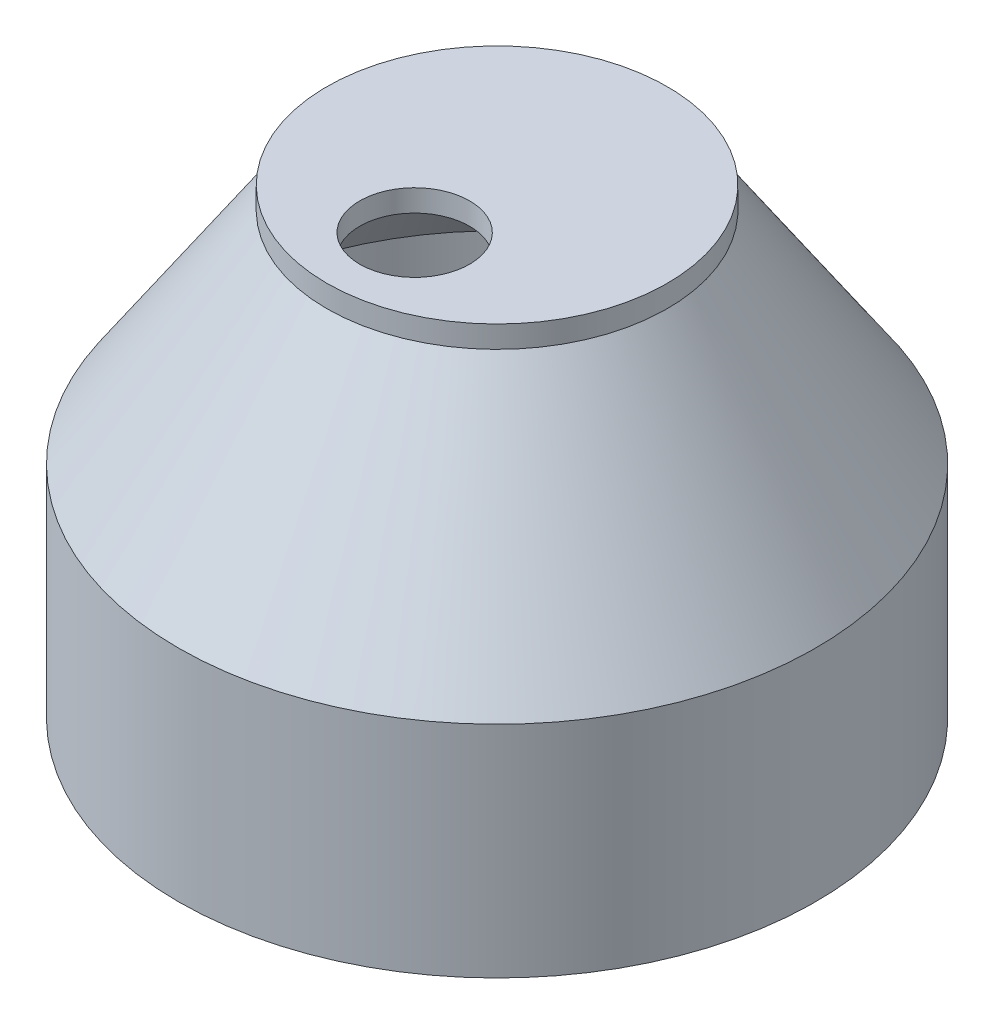
ISO-10303-21;
HEADER;
FILE_DESCRIPTION(('STEP AP214'),'2;1');
FILE_NAME('part.step','',(''),(''),'','','');
FILE_SCHEMA(('AUTOMOTIVE_DESIGN { 1 0 10303 214 1 1 1 1 }'));
ENDSEC;
DATA;
#1=APPLICATION_CONTEXT('core data for automotive mechanical design processes');
#2=APPLICATION_PROTOCOL_DEFINITION('international standard','automotive_design',2000,#1);
#3=PRODUCT_CONTEXT('',#1,'mechanical');
#4=PRODUCT('Part','Part','',(#3));
#5=PRODUCT_RELATED_PRODUCT_CATEGORY('part','',(#4));
#6=PRODUCT_DEFINITION_FORMATION('','',#4);
#7=PRODUCT_DEFINITION_CONTEXT('part definition',#1,'design');
#8=PRODUCT_DEFINITION('design','',#6,#7);
#9=PRODUCT_DEFINITION_SHAPE('','',#8);
#10=(LENGTH_UNIT() NAMED_UNIT(*) SI_UNIT(.MILLI.,.METRE.));
#11=(NAMED_UNIT(*) PLANE_ANGLE_UNIT() SI_UNIT($,.RADIAN.));
#12=(NAMED_UNIT(*) SI_UNIT($,.STERADIAN.) SOLID_ANGLE_UNIT());
#13=UNCERTAINTY_MEASURE_WITH_UNIT(LENGTH_MEASURE(1.E-05),#10,'distance_accuracy_value','');
#14=(GEOMETRIC_REPRESENTATION_CONTEXT(3) GLOBAL_UNCERTAINTY_ASSIGNED_CONTEXT((#13)) GLOBAL_UNIT_ASSIGNED_CONTEXT((#10,
#11,#12)) REPRESENTATION_CONTEXT('',''));
#15=CARTESIAN_POINT('',(0.,0.,0.));
#16=DIRECTION('',(0.,0.,1.));
#17=DIRECTION('',(1.,0.,0.));
#18=AXIS2_PLACEMENT_3D('',#15,#16,#17);
#19=CARTESIAN_POINT('',(0.,20.,0.));
#20=DIRECTION('',(0.,-1.,0.));
#21=DIRECTION('',(0.,0.,-1.));
#22=AXIS2_PLACEMENT_3D('',#19,#20,#21);
#23=CONICAL_SURFACE('',#22,12.5,0.593749666710771);
#24=CARTESIAN_POINT('',(0.,0.,0.));
#25=DIRECTION('',(0.,1.,0.));
#26=DIRECTION('',(0.,0.,1.));
#27=AXIS2_PLACEMENT_3D('',#24,#25,#26);
#28=CIRCLE('',#27,26.);
#29=CARTESIAN_POINT('',(0.,0.,26.));
#30=VERTEX_POINT('',#29);
#31=EDGE_CURVE('E59',#30,#30,#28,.T.);
#32=ORIENTED_EDGE('',*,*,#31,.F.);
#33=EDGE_LOOP('',(#32));
#34=FACE_BOUND('',#33,.T.);
#35=CARTESIAN_POINT('',(0.,20.,0.));
#36=DIRECTION('',(0.,1.,0.));
#37=DIRECTION('',(0.,0.,1.));
#38=AXIS2_PLACEMENT_3D('',#35,#36,#37);
#39=CIRCLE('',#38,12.5);
#40=CARTESIAN_POINT('',(0.,20.,12.5));
#41=VERTEX_POINT('',#40);
#42=EDGE_CURVE('E11',#41,#41,#39,.T.);
#43=ORIENTED_EDGE('',*,*,#42,.T.);
#44=EDGE_LOOP('',(#43));
#45=FACE_BOUND('',#44,.T.);
#46=ADVANCED_FACE('F37',(#34,#45),#23,.F.);
#47=CARTESIAN_POINT('',(0.,0.,0.));
#48=DIRECTION('',(0.,-1.,0.));
#49=DIRECTION('',(0.,0.,-1.));
#50=AXIS2_PLACEMENT_3D('',#47,#48,#49);
#51=CONICAL_SURFACE('',#50,29.,0.593749666710771);
#52=CARTESIAN_POINT('',(0.,20.,0.));
#53=DIRECTION('',(0.,1.,0.));
#54=DIRECTION('',(0.,0.,1.));
#55=AXIS2_PLACEMENT_3D('',#52,#53,#54);
#56=CIRCLE('',#55,15.5);
#57=CARTESIAN_POINT('',(0.,20.,15.5));
#58=VERTEX_POINT('',#57);
#59=EDGE_CURVE('E43',#58,#58,#56,.T.);
#60=ORIENTED_EDGE('',*,*,#59,.F.);
#61=EDGE_LOOP('',(#60));
#62=FACE_BOUND('',#61,.T.);
#63=CARTESIAN_POINT('',(0.,0.,0.));
#64=DIRECTION('',(0.,1.,0.));
#65=DIRECTION('',(0.,0.,1.));
#66=AXIS2_PLACEMENT_3D('',#63,#64,#65);
#67=CIRCLE('',#66,29.);
#68=CARTESIAN_POINT('',(0.,0.,29.));
#69=VERTEX_POINT('',#68);
#70=EDGE_CURVE('E68',#69,#69,#67,.T.);
#71=ORIENTED_EDGE('',*,*,#70,.T.);
#72=EDGE_LOOP('',(#71));
#73=FACE_BOUND('',#72,.T.);
#74=ADVANCED_FACE('F75',(#62,#73),#51,.T.);
#75=CARTESIAN_POINT('',(0.,40.2842566481518,0.));
#76=DIRECTION('',(0.,1.,0.));
#77=DIRECTION('',(0.,0.,1.));
#78=AXIS2_PLACEMENT_3D('',#75,#76,#77);
#79=CYLINDRICAL_SURFACE('',#78,29.);
#80=ORIENTED_EDGE('',*,*,#70,.F.);
#81=EDGE_LOOP('',(#80));
#82=FACE_BOUND('',#81,.T.);
#83=CARTESIAN_POINT('',(0.,-20.,0.));
#84=DIRECTION('',(0.,1.,0.));
#85=DIRECTION('',(0.,0.,1.));
#86=AXIS2_PLACEMENT_3D('',#83,#84,#85);
#87=CIRCLE('',#86,29.);
#88=CARTESIAN_POINT('',(0.,-20.,29.));
#89=VERTEX_POINT('',#88);
#90=EDGE_CURVE('E65',#89,#89,#87,.T.);
#91=ORIENTED_EDGE('',*,*,#90,.T.);
#92=EDGE_LOOP('',(#91));
#93=FACE_BOUND('',#92,.T.);
#94=ADVANCED_FACE('F78',(#82,#93),#79,.T.);
#95=CARTESIAN_POINT('',(0.,-20.,-29.));
#96=DIRECTION('',(0.,1.,0.));
#97=DIRECTION('',(0.,0.,1.));
#98=AXIS2_PLACEMENT_3D('',#95,#96,#97);
#99=PLANE('',#98);
#100=ORIENTED_EDGE('',*,*,#90,.F.);
#101=EDGE_LOOP('',(#100));
#102=FACE_BOUND('',#101,.T.);
#103=CARTESIAN_POINT('',(0.,-20.,0.));
#104=DIRECTION('',(0.,1.,0.));
#105=DIRECTION('',(0.,0.,1.));
#106=AXIS2_PLACEMENT_3D('',#103,#104,#105);
#107=CIRCLE('',#106,26.);
#108=CARTESIAN_POINT('',(0.,-20.,26.));
#109=VERTEX_POINT('',#108);
#110=EDGE_CURVE('E62',#109,#109,#107,.T.);
#111=ORIENTED_EDGE('',*,*,#110,.T.);
#112=EDGE_LOOP('',(#111));
#113=FACE_BOUND('',#112,.T.);
#114=ADVANCED_FACE('F83',(#102,#113),#99,.F.);
#115=CARTESIAN_POINT('',(0.,40.2842566481518,0.));
#116=DIRECTION('',(0.,1.,0.));
#117=DIRECTION('',(0.,0.,1.));
#118=AXIS2_PLACEMENT_3D('',#115,#116,#117);
#119=CYLINDRICAL_SURFACE('',#118,26.);
#120=ORIENTED_EDGE('',*,*,#110,.F.);
#121=EDGE_LOOP('',(#120));
#122=FACE_BOUND('',#121,.T.);
#123=ORIENTED_EDGE('',*,*,#31,.T.);
#124=EDGE_LOOP('',(#123));
#125=FACE_BOUND('',#124,.T.);
#126=ADVANCED_FACE('F89',(#122,#125),#119,.F.);
#127=CARTESIAN_POINT('',(0.,20.,0.));
#128=DIRECTION('',(0.,1.,0.));
#129=DIRECTION('',(0.,0.,1.));
#130=AXIS2_PLACEMENT_3D('',#127,#128,#129);
#131=PLANE('',#130);
#132=CARTESIAN_POINT('',(0.,20.,7.5));
#133=DIRECTION('',(0.,1.,0.));
#134=DIRECTION('',(0.,0.,1.));
#135=AXIS2_PLACEMENT_3D('',#132,#133,#134);
#136=CIRCLE('',#135,5.);
#137=EDGE_CURVE('E47',#41,#41,#136,.T.);
#138=ORIENTED_EDGE('',*,*,#137,.T.);
#139=ORIENTED_EDGE('',*,*,#42,.F.);
#140=EDGE_LOOP('',(#138,#139));
#141=FACE_BOUND('',#140,.T.);
#142=ADVANCED_FACE('F95',(#141),#131,.F.);
#143=CARTESIAN_POINT('',(0.,22.,0.));
#144=DIRECTION('',(0.,1.,0.));
#145=DIRECTION('',(0.,0.,1.));
#146=AXIS2_PLACEMENT_3D('',#143,#144,#145);
#147=PLANE('',#146);
#148=CARTESIAN_POINT('',(0.,22.,0.));
#149=DIRECTION('',(0.,1.,0.));
#150=DIRECTION('',(0.,0.,1.));
#151=AXIS2_PLACEMENT_3D('',#148,#149,#150);
#152=CIRCLE('',#151,15.5);
#153=CARTESIAN_POINT('',(0.,22.,15.5));
#154=VERTEX_POINT('',#153);
#155=EDGE_CURVE('E54',#154,#154,#152,.T.);
#156=ORIENTED_EDGE('',*,*,#155,.T.);
#157=EDGE_LOOP('',(#156));
#158=FACE_BOUND('',#157,.T.);
#159=CARTESIAN_POINT('',(0.,22.,7.5));
#160=DIRECTION('',(0.,1.,0.));
#161=DIRECTION('',(0.,0.,1.));
#162=AXIS2_PLACEMENT_3D('',#159,#160,#161);
#163=CIRCLE('',#162,5.);
#164=CARTESIAN_POINT('',(0.,22.,12.5));
#165=VERTEX_POINT('',#164);
#166=EDGE_CURVE('E51',#165,#165,#163,.T.);
#167=ORIENTED_EDGE('',*,*,#166,.F.);
#168=EDGE_LOOP('',(#167));
#169=FACE_BOUND('',#168,.T.);
#170=ADVANCED_FACE('F102',(#158,#169),#147,.T.);
#171=CARTESIAN_POINT('',(0.,22.,0.));
#172=DIRECTION('',(0.,-1.,0.));
#173=DIRECTION('',(0.,0.,-1.));
#174=AXIS2_PLACEMENT_3D('',#171,#172,#173);
#175=CYLINDRICAL_SURFACE('',#174,15.5);
#176=ORIENTED_EDGE('',*,*,#155,.F.);
#177=EDGE_LOOP('',(#176));
#178=FACE_BOUND('',#177,.T.);
#179=ORIENTED_EDGE('',*,*,#59,.T.);
#180=EDGE_LOOP('',(#179));
#181=FACE_BOUND('',#180,.T.);
#182=ADVANCED_FACE('F73',(#178,#181),#175,.T.);
#183=CARTESIAN_POINT('',(0.,22.,7.5));
#184=DIRECTION('',(0.,-1.,0.));
#185=DIRECTION('',(0.,0.,-1.));
#186=AXIS2_PLACEMENT_3D('',#183,#184,#185);
#187=CYLINDRICAL_SURFACE('',#186,5.);
#188=ORIENTED_EDGE('',*,*,#166,.T.);
#189=EDGE_LOOP('',(#188));
#190=FACE_BOUND('',#189,.T.);
#191=ORIENTED_EDGE('',*,*,#137,.F.);
#192=EDGE_LOOP('',(#191));
#193=FACE_BOUND('',#192,.T.);
#194=ADVANCED_FACE('F48',(#190,#193),#187,.F.);
#195=CLOSED_SHELL('',(#46,#74,#94,#114,#126,#142,#170,#182,#194));
#196=MANIFOLD_SOLID_BREP('B2',#195);
#197=ADVANCED_BREP_SHAPE_REPRESENTATION('',(#18,#196),#14);
#198=SHAPE_DEFINITION_REPRESENTATION(#9,#197);
ENDSEC;
END-ISO-10303-21;
